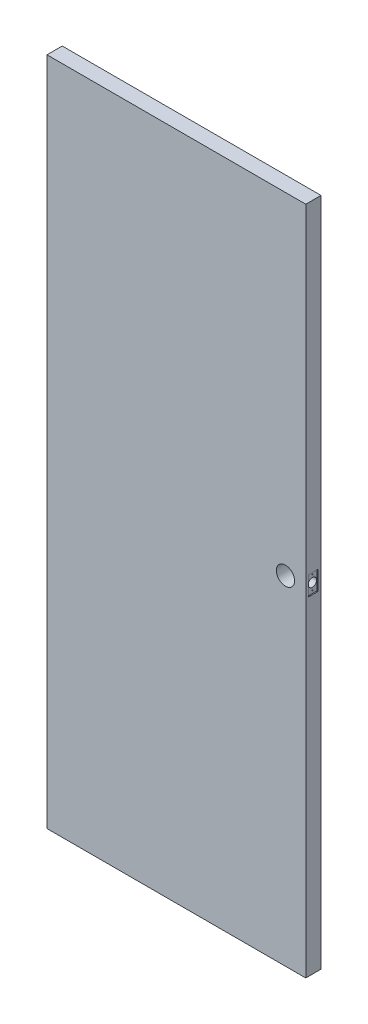
ISO-10303-21;
HEADER;
FILE_DESCRIPTION(('STEP AP214'),'2;1');
FILE_NAME('part.step','',(''),(''),'','','');
FILE_SCHEMA(('AUTOMOTIVE_DESIGN { 1 0 10303 214 1 1 1 1 }'));
ENDSEC;
DATA;
#1=APPLICATION_CONTEXT('core data for automotive mechanical design processes');
#2=APPLICATION_PROTOCOL_DEFINITION('international standard','automotive_design',2000,#1);
#3=PRODUCT_CONTEXT('',#1,'mechanical');
#4=PRODUCT('Part','Part','',(#3));
#5=PRODUCT_RELATED_PRODUCT_CATEGORY('part','',(#4));
#6=PRODUCT_DEFINITION_FORMATION('','',#4);
#7=PRODUCT_DEFINITION_CONTEXT('part definition',#1,'design');
#8=PRODUCT_DEFINITION('design','',#6,#7);
#9=PRODUCT_DEFINITION_SHAPE('','',#8);
#10=(LENGTH_UNIT() NAMED_UNIT(*) SI_UNIT(.MILLI.,.METRE.));
#11=(NAMED_UNIT(*) PLANE_ANGLE_UNIT() SI_UNIT($,.RADIAN.));
#12=(NAMED_UNIT(*) SI_UNIT($,.STERADIAN.) SOLID_ANGLE_UNIT());
#13=UNCERTAINTY_MEASURE_WITH_UNIT(LENGTH_MEASURE(1.E-05),#10,'distance_accuracy_value','');
#14=(GEOMETRIC_REPRESENTATION_CONTEXT(3) GLOBAL_UNCERTAINTY_ASSIGNED_CONTEXT((#13)) GLOBAL_UNIT_ASSIGNED_CONTEXT((#10,
#11,#12)) REPRESENTATION_CONTEXT('',''));
#15=CARTESIAN_POINT('',(0.,0.,0.));
#16=DIRECTION('',(0.,0.,1.));
#17=DIRECTION('',(1.,0.,0.));
#18=AXIS2_PLACEMENT_3D('',#15,#16,#17);
#19=CARTESIAN_POINT('',(-0.00100000000002876,1000.,22.5));
#20=DIRECTION('',(1.,0.,0.));
#21=DIRECTION('',(0.,0.,-1.));
#22=AXIS2_PLACEMENT_3D('',#19,#20,#21);
#23=CYLINDRICAL_SURFACE('',#22,12.5);
#24=CARTESIAN_POINT('',(732.,1000.,10.));
#25=CARTESIAN_POINT('',(731.999998002447,999.668422088761,10.0000023292743));
#26=CARTESIAN_POINT('',(731.993876440677,999.336779157179,10.0132099179336));
#27=CARTESIAN_POINT('',(731.969542185221,998.675898449838,10.0659042675992));
#28=CARTESIAN_POINT('',(731.951323109001,998.346662036484,10.1054049005938));
#29=CARTESIAN_POINT('',(731.903222023394,997.692533881601,10.210348474757));
#30=CARTESIAN_POINT('',(731.873316689022,997.367652181542,10.2758433027091));
#31=CARTESIAN_POINT('',(731.802623291495,996.725278561628,10.4320482504398));
#32=CARTESIAN_POINT('',(731.761836592468,996.407785720899,10.5227552095947));
#33=CARTESIAN_POINT('',(731.67057378094,995.7834036811,10.7280873639002));
#34=CARTESIAN_POINT('',(731.620133973199,995.476479681353,10.8426230768386));
#35=CARTESIAN_POINT('',(731.510684660548,994.873851344575,11.0947689030026));
#36=CARTESIAN_POINT('',(731.451674915464,994.578147322279,11.2323796629288));
#37=CARTESIAN_POINT('',(731.326491751328,993.999719630825,11.5294802018012));
#38=CARTESIAN_POINT('',(731.260321642744,993.716990048537,11.6889598790732));
#39=CARTESIAN_POINT('',(731.12226557469,993.165671942841,12.0287600834887));
#40=CARTESIAN_POINT('',(731.050377373706,992.897089034242,12.209088796221));
#41=CARTESIAN_POINT('',(730.898511464959,992.361365543337,12.5996472343398));
#42=CARTESIAN_POINT('',(730.818306596493,992.095081805128,12.8109643225546));
#43=CARTESIAN_POINT('',(730.655286671351,991.581033972636,13.2541260156496));
#44=CARTESIAN_POINT('',(730.572471490004,991.33327076483,13.4859716019587));
#45=CARTESIAN_POINT('',(730.406215284922,990.857363867813,13.9690432097703));
#46=CARTESIAN_POINT('',(730.322773954442,990.629230584159,14.2202793777351));
#47=CARTESIAN_POINT('',(730.157389610383,990.193880031075,14.7408019077799));
#48=CARTESIAN_POINT('',(730.075446862375,989.986666440073,15.0100914304786));
#49=CARTESIAN_POINT('',(729.910068553279,989.58177868194,15.5832420420382));
#50=CARTESIAN_POINT('',(729.82687521964,989.385572316778,15.8882127104353));
#51=CARTESIAN_POINT('',(729.667289866953,989.019807464747,16.5152648469024));
#52=CARTESIAN_POINT('',(729.590894995629,988.850237779464,16.8373390478071));
#53=CARTESIAN_POINT('',(729.447482436656,988.539199671144,17.4967122735494));
#54=CARTESIAN_POINT('',(729.380462393697,988.397724186027,17.83400744604));
#55=CARTESIAN_POINT('',(729.258260922285,988.144343377493,18.5216067566667));
#56=CARTESIAN_POINT('',(729.203078379146,988.032435269615,18.8719096662737));
#57=CARTESIAN_POINT('',(729.109421635052,987.844911955487,19.563180810335));
#58=CARTESIAN_POINT('',(729.070192607417,987.767632859612,19.9035950793588));
#59=CARTESIAN_POINT('',(729.005775202167,987.641691688417,20.5909991877625));
#60=CARTESIAN_POINT('',(728.980586302548,987.593028549169,20.9379887821796));
#61=CARTESIAN_POINT('',(728.945279280196,987.52502200683,21.6353691106166));
#62=CARTESIAN_POINT('',(728.935151348151,987.505659519877,21.9857574811567));
#63=CARTESIAN_POINT('',(728.930358970788,987.496482132574,22.6870147093001));
#64=CARTESIAN_POINT('',(728.935693391853,987.506665066112,23.0378835297942));
#65=CARTESIAN_POINT('',(728.960309439594,987.553949811395,23.7023075068291));
#66=CARTESIAN_POINT('',(728.978157901728,987.588286641967,24.0161176181592));
#67=CARTESIAN_POINT('',(729.025617311446,987.680405966638,24.6393487972412));
#68=CARTESIAN_POINT('',(729.055227354877,987.738186658535,24.9487702004752));
#69=CARTESIAN_POINT('',(729.125270949122,987.876580449968,25.5612585504465));
#70=CARTESIAN_POINT('',(729.165706554747,987.957197884339,25.8643242790183));
#71=CARTESIAN_POINT('',(729.25617478444,988.140471526853,26.4622432955294));
#72=CARTESIAN_POINT('',(729.306207857588,988.2431287663,26.7570961984382));
#73=CARTESIAN_POINT('',(729.415681060451,988.472164924883,27.3435907186567));
#74=CARTESIAN_POINT('',(729.475309089342,988.599029803314,27.6350071779858));
#75=CARTESIAN_POINT('',(729.601492511707,988.873929898133,28.2062314693331));
#76=CARTESIAN_POINT('',(729.668050402359,989.021972753249,28.4860350654999));
#77=CARTESIAN_POINT('',(729.806375935256,989.338222752103,29.0327053438451));
#78=CARTESIAN_POINT('',(729.878144394206,989.506433059594,29.2995699869903));
#79=CARTESIAN_POINT('',(730.0251587382,989.8620295164,29.8191999142336));
#80=CARTESIAN_POINT('',(730.100404863738,990.049416992979,30.0719642205662));
#81=CARTESIAN_POINT('',(730.260811815036,990.463449830648,30.5885839334457));
#82=CARTESIAN_POINT('',(730.346172212179,990.69215041206,30.8507335191324));
#83=CARTESIAN_POINT('',(730.516752133651,991.170514419783,31.3549943936451));
#84=CARTESIAN_POINT('',(730.601971698225,991.420170110671,31.5971130117875));
#85=CARTESIAN_POINT('',(730.770170579597,991.939427311406,32.0602448425317));
#86=CARTESIAN_POINT('',(730.853148116905,992.209044064296,32.2812416244214));
#87=CARTESIAN_POINT('',(731.014636740145,992.766545995786,32.7004276246339));
#88=CARTESIAN_POINT('',(731.093149622741,993.054423725738,32.8986260507639));
#89=CARTESIAN_POINT('',(731.246350432207,993.657354201341,33.2773816460067));
#90=CARTESIAN_POINT('',(731.320809390704,993.973004601278,33.4570822419527));
#91=CARTESIAN_POINT('',(731.46071248318,994.620376764097,33.7890196935255));
#92=CARTESIAN_POINT('',(731.526156291861,994.952099106326,33.9412555581931));
#93=CARTESIAN_POINT('',(731.646080640694,995.629131353904,34.2166109326683));
#94=CARTESIAN_POINT('',(731.700567209032,995.97443366245,34.3397464587554));
#95=CARTESIAN_POINT('',(731.796963703763,996.676131920866,34.5555629923018));
#96=CARTESIAN_POINT('',(731.838874844723,997.032526795715,34.6482469409353));
#97=CARTESIAN_POINT('',(731.906207462756,997.726590860271,34.7962596081731));
#98=CARTESIAN_POINT('',(731.93262339186,998.063681756838,34.853853630447));
#99=CARTESIAN_POINT('',(731.972826795685,998.742192371953,34.9412579829527));
#100=CARTESIAN_POINT('',(731.986614891807,999.083611876658,34.9710696803249));
#101=CARTESIAN_POINT('',(732.001170776422,999.767911454575,35.0025364139408));
#102=CARTESIAN_POINT('',(732.001942776283,1000.11079101947,35.0042005573506));
#103=CARTESIAN_POINT('',(731.990454774749,1000.79530317664,34.9793739128589));
#104=CARTESIAN_POINT('',(731.978195202305,1001.1369358096,34.9528840516833));
#105=CARTESIAN_POINT('',(731.942192477616,1001.7943207997,34.8746856095642));
#106=CARTESIAN_POINT('',(731.919238598402,1002.11032451672,34.8247085346885));
#107=CARTESIAN_POINT('',(731.862792148742,1002.73665069614,34.7009276708533));
#108=CARTESIAN_POINT('',(731.829300140859,1003.04697346088,34.6271251537757));
#109=CARTESIAN_POINT('',(731.752570857058,1003.65997073146,34.4564148603405));
#110=CARTESIAN_POINT('',(731.709332964537,1003.96264475203,34.3595056220429));
#111=CARTESIAN_POINT('',(731.614109587101,1004.5585332442,34.1434628193551));
#112=CARTESIAN_POINT('',(731.562123752895,1004.85174733752,34.0243283675231));
#113=CARTESIAN_POINT('',(731.448859367079,1005.43590297559,33.7608497999407));
#114=CARTESIAN_POINT('',(731.387345438136,1005.72650142557,33.6158467076901));
#115=CARTESIAN_POINT('',(731.257647426588,1006.29451044103,33.304355702977));
#116=CARTESIAN_POINT('',(731.189460946475,1006.57191621268,33.1378600611432));
#117=CARTESIAN_POINT('',(731.047942159905,1007.1121517761,32.7845270705439));
#118=CARTESIAN_POINT('',(730.97460872244,1007.37497834135,32.5976852458446));
#119=CARTESIAN_POINT('',(730.824422135181,1007.8847858184,32.2048296901034));
#120=CARTESIAN_POINT('',(730.747569105365,1008.13176726965,31.9988166123398));
#121=CARTESIAN_POINT('',(730.58526394341,1008.62951918284,31.5500391804311));
#122=CARTESIAN_POINT('',(730.499644091669,1008.87876057277,31.3056370408377));
#123=CARTESIAN_POINT('',(730.328447301136,1009.35596249524,30.7968444935493));
#124=CARTESIAN_POINT('',(730.24287036468,1009.58392197323,30.5324530965312));
#125=CARTESIAN_POINT('',(730.074024651927,1010.01735543162,29.9849540358408));
#126=CARTESIAN_POINT('',(729.990756816071,1010.22282034813,29.7018389008449));
#127=CARTESIAN_POINT('',(729.828907380942,1010.60987173198,29.1183977359458));
#128=CARTESIAN_POINT('',(729.75032636771,1010.79145521658,28.8180695628905));
#129=CARTESIAN_POINT('',(729.597889486629,1011.13463942771,28.1921965750285));
#130=CARTESIAN_POINT('',(729.524257367953,1011.29544048205,27.8661574664116));
#131=CARTESIAN_POINT('',(729.387096528789,1011.58860330392,27.1996529851551));
#132=CARTESIAN_POINT('',(729.323563027758,1011.72097853831,26.859194535678));
#133=CARTESIAN_POINT('',(729.2089888989,1011.95583297549,26.1663021227683));
#134=CARTESIAN_POINT('',(729.157940141583,1012.05833164092,25.8138761232562));
#135=CARTESIAN_POINT('',(729.070370907316,1012.23220177018,25.0996665219084));
#136=CARTESIAN_POINT('',(729.033848591179,1012.30357717463,24.7378841108664));
#137=CARTESIAN_POINT('',(728.979456262878,1012.40922500796,24.0408048554866));
#138=CARTESIAN_POINT('',(728.960211397828,1012.44624245167,23.7060292923018));
#139=CARTESIAN_POINT('',(728.935800565152,1012.49312478279,23.0340747125841));
#140=CARTESIAN_POINT('',(728.930633720352,1012.50299136193,22.6968958471091));
#141=CARTESIAN_POINT('',(728.934577570304,1012.4954395509,22.0230114925559));
#142=CARTESIAN_POINT('',(728.943684949675,1012.47802749657,21.6863059117301));
#143=CARTESIAN_POINT('',(728.975821329516,1012.41616696706,21.0160687907706));
#144=CARTESIAN_POINT('',(728.998850018876,1012.37171909607,20.6825371798751));
#145=CARTESIAN_POINT('',(729.055861942092,1012.26046888288,20.0447729393511));
#146=CARTESIAN_POINT('',(729.088951367825,1012.19547766473,19.7401413486756));
#147=CARTESIAN_POINT('',(729.165385576091,1012.04331286044,19.1376830667892));
#148=CARTESIAN_POINT('',(729.20873382275,1011.95613178064,18.8398587115292));
#149=CARTESIAN_POINT('',(729.304416754455,1011.76040719833,18.2528169077572));
#150=CARTESIAN_POINT('',(729.356751443573,1011.65186368614,17.9635994631452));
#151=CARTESIAN_POINT('',(729.468984507458,1011.41429136517,17.3952133095522));
#152=CARTESIAN_POINT('',(729.528883541773,1011.28526076982,17.1160454795464));
#153=CARTESIAN_POINT('',(729.658872556049,1010.99847208286,16.551008800755));
#154=CARTESIAN_POINT('',(729.72937401517,1010.83938107201,16.2659110681214));
#155=CARTESIAN_POINT('',(729.87534862186,1010.50005406822,15.7099379846379));
#156=CARTESIAN_POINT('',(729.95082192564,1010.31981741076,15.4390630811362));
#157=CARTESIAN_POINT('',(730.104869473538,1009.93919931139,14.9126523276877));
#158=CARTESIAN_POINT('',(730.183444742502,1009.73881117729,14.6571216187524));
#159=CARTESIAN_POINT('',(730.341811170788,1009.31895665893,14.1625976325898));
#160=CARTESIAN_POINT('',(730.421602502945,1009.09948754151,13.9236067333728));
#161=CARTESIAN_POINT('',(730.588393234833,1008.62001858761,13.4406307683937));
#162=CARTESIAN_POINT('',(730.675329185726,1008.35815559465,13.1984690048692));
#163=CARTESIAN_POINT('',(730.846074602858,1007.81419586295,12.7370339300526));
#164=CARTESIAN_POINT('',(730.92988510694,1007.53210593341,12.5177529766264));
#165=CARTESIAN_POINT('',(731.092222890284,1006.9489257823,12.1033432132673));
#166=CARTESIAN_POINT('',(731.17074619966,1006.64782160551,11.9082324611957));
#167=CARTESIAN_POINT('',(731.320294507113,1006.02855979943,11.543928796161));
#168=CARTESIAN_POINT('',(731.391320042185,1005.7104033939,11.3747340266876));
#169=CARTESIAN_POINT('',(731.523464311231,1005.06111467693,11.0648048984841));
#170=CARTESIAN_POINT('',(731.58464362823,1004.73007861109,10.9238950641157));
#171=CARTESIAN_POINT('',(731.695897050195,1004.05536304014,10.670635169424));
#172=CARTESIAN_POINT('',(731.745969462335,1003.71168161703,10.5582894622394));
#173=CARTESIAN_POINT('',(731.833388973569,1003.01530510901,10.3637610725984));
#174=CARTESIAN_POINT('',(731.870769661409,1002.66263651378,10.2814987290438));
#175=CARTESIAN_POINT('',(731.931822002458,1001.95051104947,10.1478099963477));
#176=CARTESIAN_POINT('',(731.955502809403,1001.59105887914,10.0963630167452));
#177=CARTESIAN_POINT('',(731.981288768876,1001.02563525442,10.0404565701127));
#178=CARTESIAN_POINT('',(731.988298104388,1000.8208802782,10.0252931071275));
#179=CARTESIAN_POINT('',(731.997654381966,1000.41075852501,10.0050640067928));
#180=CARTESIAN_POINT('',(732.000001237359,1000.20539173674,9.99999855716059));
#181=CARTESIAN_POINT('',(732.,1000.,10.));
#182=B_SPLINE_CURVE_WITH_KNOTS('',3,(#24,#25,#26,#27,#28,#29,#30,#31,#32,#33,#34,#35,#36,#37,
#38,#39,#40,#41,#42,#43,#44,#45,#46,#47,#48,#49,#50,#51,#52,#53,#54,#55,#56,#57,#58,#59,#60,#61,
#62,#63,#64,#65,#66,#67,#68,#69,#70,#71,#72,#73,#74,#75,#76,#77,#78,#79,#80,#81,#82,#83,#84,#85,
#86,#87,#88,#89,#90,#91,#92,#93,#94,#95,#96,#97,#98,#99,#100,#101,#102,#103,#104,#105,#106,#107,
#108,#109,#110,#111,#112,#113,#114,#115,#116,#117,#118,#119,#120,#121,#122,#123,#124,#125,#126,
#127,#128,#129,#130,#131,#132,#133,#134,#135,#136,#137,#138,#139,#140,#141,#142,#143,#144,#145,
#146,#147,#148,#149,#150,#151,#152,#153,#154,#155,#156,#157,#158,#159,#160,#161,#162,#163,#164,
#165,#166,#167,#168,#169,#170,#171,#172,#173,#174,#175,#176,#177,#178,#179,#180,#181),
.UNSPECIFIED.,.T.,.F.,(4,2,2,2,2,2,2,2,2,2,2,2,2,2,2,2,2,2,2,2,2,2,2,2,2,2,2,2,2,2,2,2,2,2,2,2,
2,2,2,2,2,2,2,2,2,2,2,2,2,2,2,2,2,2,2,2,2,2,2,2,2,2,2,2,2,2,2,2,2,2,2,2,2,2,2,2,2,2,4),(0.,
0.994528985060413,1.98958309154408,2.98663348748122,3.98355894829082,4.97680620638525,
5.97008130585068,6.96289912832716,7.95610807553238,9.00281218361373,10.0495663597,
11.0968720310039,12.1443615363848,13.259137856263,14.3734442477634,15.4874701788891,
16.6013911609791,17.6537534221179,18.7060765544402,19.7577140008262,20.809274348728,
21.7567226158427,22.7040980634081,23.6516534608806,24.5992532067505,25.5683821321694,
26.5378615001713,27.5074931539078,28.4771919618501,29.5506185450002,30.6236506088654,
31.6975107057955,32.7709355575334,33.8818053930425,34.9927153020036,36.1030123556248,
37.2132021393455,38.240835559975,39.2684184091204,40.2956687765619,41.322885331759,
42.2840367794968,43.2451369262296,44.2062978969834,45.167497254631,46.1580617752712,
47.148983530548,48.1401237196649,49.1312301471257,50.2082920748067,51.2854073441793,
52.362955038245,53.4406371877421,54.551924072665,55.6626833131646,56.7727173409769,
57.8826107829373,58.8933496517613,59.9040255419017,60.9144667237074,61.9248853252646,
62.8635679111351,63.8025679180065,64.7415683503573,65.6806507124922,66.6816292250223,
67.6826392023157,68.6839827139265,69.6854698958439,70.7855197216834,71.8852009495488,
72.985698870598,74.0861179197721,75.1794834378249,76.2730154837198,77.3636305095056,
78.4535159839474,79.0695529134892,79.6856012947562),.UNSPECIFIED.);
#183=CARTESIAN_POINT('',(732.,1000.,10.));
#184=VERTEX_POINT('',#183);
#185=EDGE_CURVE('E151',#184,#184,#182,.T.);
#186=ORIENTED_EDGE('',*,*,#185,.T.);
#187=EDGE_LOOP('',(#186));
#188=FACE_BOUND('',#187,.T.);
#189=CARTESIAN_POINT('',(762.,1000.,22.5));
#190=DIRECTION('',(1.,0.,0.));
#191=DIRECTION('',(0.,0.,-1.));
#192=AXIS2_PLACEMENT_3D('',#189,#190,#191);
#193=CIRCLE('',#192,12.5);
#194=CARTESIAN_POINT('',(762.,1000.,10.));
#195=VERTEX_POINT('',#194);
#196=EDGE_CURVE('E37',#195,#195,#193,.F.);
#197=ORIENTED_EDGE('',*,*,#196,.F.);
#198=EDGE_LOOP('',(#197));
#199=FACE_BOUND('',#198,.T.);
#200=ADVANCED_FACE('F33',(#188,#199),#23,.F.);
#201=CARTESIAN_POINT('',(0.,0.,45.));
#202=DIRECTION('',(1.,0.,0.));
#203=DIRECTION('',(0.,0.,-1.));
#204=AXIS2_PLACEMENT_3D('',#201,#202,#203);
#205=PLANE('',#204);
#206=DIRECTION('',(0.,-1.,0.));
#207=VECTOR('',#206,1.);
#208=CARTESIAN_POINT('',(0.,0.,0.));
#209=LINE('',#208,#207);
#210=CARTESIAN_POINT('',(0.,1981.,0.));
#211=VERTEX_POINT('',#210);
#212=CARTESIAN_POINT('',(0.,0.,0.));
#213=VERTEX_POINT('',#212);
#214=EDGE_CURVE('E221',#211,#213,#209,.T.);
#215=ORIENTED_EDGE('',*,*,#214,.T.);
#216=DIRECTION('',(0.,0.,-1.));
#217=VECTOR('',#216,1.);
#218=CARTESIAN_POINT('',(0.,0.,45.));
#219=LINE('',#218,#217);
#220=CARTESIAN_POINT('',(0.,0.,45.));
#221=VERTEX_POINT('',#220);
#222=EDGE_CURVE('E11',#221,#213,#219,.T.);
#223=ORIENTED_EDGE('',*,*,#222,.F.);
#224=DIRECTION('',(0.,-1.,0.));
#225=VECTOR('',#224,1.);
#226=CARTESIAN_POINT('',(0.,0.,45.));
#227=LINE('',#226,#225);
#228=CARTESIAN_POINT('',(0.,1981.,45.));
#229=VERTEX_POINT('',#228);
#230=EDGE_CURVE('E223',#229,#221,#227,.T.);
#231=ORIENTED_EDGE('',*,*,#230,.F.);
#232=DIRECTION('',(0.,0.,-1.));
#233=VECTOR('',#232,1.);
#234=CARTESIAN_POINT('',(0.,1981.,45.));
#235=LINE('',#234,#233);
#236=EDGE_CURVE('E229',#229,#211,#235,.T.);
#237=ORIENTED_EDGE('',*,*,#236,.T.);
#238=EDGE_LOOP('',(#215,#223,#231,#237));
#239=FACE_BOUND('',#238,.T.);
#240=ADVANCED_FACE('F35',(#239),#205,.F.);
#241=CARTESIAN_POINT('',(0.,0.,45.));
#242=DIRECTION('',(0.,1.,0.));
#243=DIRECTION('',(0.,0.,1.));
#244=AXIS2_PLACEMENT_3D('',#241,#242,#243);
#245=PLANE('',#244);
#246=DIRECTION('',(1.,0.,0.));
#247=VECTOR('',#246,1.);
#248=CARTESIAN_POINT('',(0.,0.,0.));
#249=LINE('',#248,#247);
#250=CARTESIAN_POINT('',(765.,0.,0.));
#251=VERTEX_POINT('',#250);
#252=EDGE_CURVE('E232',#213,#251,#249,.T.);
#253=ORIENTED_EDGE('',*,*,#252,.T.);
#254=DIRECTION('',(0.,0.,-1.));
#255=VECTOR('',#254,1.);
#256=CARTESIAN_POINT('',(765.,0.,45.));
#257=LINE('',#256,#255);
#258=CARTESIAN_POINT('',(765.,0.,45.));
#259=VERTEX_POINT('',#258);
#260=EDGE_CURVE('E42',#259,#251,#257,.T.);
#261=ORIENTED_EDGE('',*,*,#260,.F.);
#262=DIRECTION('',(1.,0.,0.));
#263=VECTOR('',#262,1.);
#264=CARTESIAN_POINT('',(0.,0.,45.));
#265=LINE('',#264,#263);
#266=EDGE_CURVE('E86',#221,#259,#265,.T.);
#267=ORIENTED_EDGE('',*,*,#266,.F.);
#268=ORIENTED_EDGE('',*,*,#222,.T.);
#269=EDGE_LOOP('',(#253,#261,#267,#268));
#270=FACE_BOUND('',#269,.T.);
#271=ADVANCED_FACE('F205',(#270),#245,.F.);
#272=CARTESIAN_POINT('',(765.,0.,45.));
#273=DIRECTION('',(-1.,0.,0.));
#274=DIRECTION('',(0.,0.,1.));
#275=AXIS2_PLACEMENT_3D('',#272,#273,#274);
#276=PLANE('',#275);
#277=DIRECTION('',(0.,0.,-1.));
#278=VECTOR('',#277,1.);
#279=CARTESIAN_POINT('',(765.,971.5,36.75));
#280=LINE('',#279,#278);
#281=CARTESIAN_POINT('',(765.,971.5,36.75));
#282=VERTEX_POINT('',#281);
#283=CARTESIAN_POINT('',(765.,971.5,8.24999999999999));
#284=VERTEX_POINT('',#283);
#285=EDGE_CURVE('E141',#282,#284,#280,.T.);
#286=ORIENTED_EDGE('',*,*,#285,.F.);
#287=DIRECTION('',(0.,-1.,0.));
#288=VECTOR('',#287,1.);
#289=CARTESIAN_POINT('',(765.,1028.5,36.75));
#290=LINE('',#289,#288);
#291=CARTESIAN_POINT('',(765.,1028.5,36.75));
#292=VERTEX_POINT('',#291);
#293=EDGE_CURVE('E49',#292,#282,#290,.T.);
#294=ORIENTED_EDGE('',*,*,#293,.F.);
#295=DIRECTION('',(0.,0.,1.));
#296=VECTOR('',#295,1.);
#297=CARTESIAN_POINT('',(765.,1028.5,36.75));
#298=LINE('',#297,#296);
#299=CARTESIAN_POINT('',(765.,1028.5,8.25));
#300=VERTEX_POINT('',#299);
#301=EDGE_CURVE('E129',#300,#292,#298,.T.);
#302=ORIENTED_EDGE('',*,*,#301,.F.);
#303=DIRECTION('',(0.,1.,0.));
#304=VECTOR('',#303,1.);
#305=CARTESIAN_POINT('',(765.,1028.5,8.25));
#306=LINE('',#305,#304);
#307=EDGE_CURVE('E132',#284,#300,#306,.T.);
#308=ORIENTED_EDGE('',*,*,#307,.F.);
#309=EDGE_LOOP('',(#286,#294,#302,#308));
#310=FACE_BOUND('',#309,.T.);
#311=DIRECTION('',(0.,1.,0.));
#312=VECTOR('',#311,1.);
#313=CARTESIAN_POINT('',(765.,0.,0.));
#314=LINE('',#313,#312);
#315=CARTESIAN_POINT('',(765.,1981.,0.));
#316=VERTEX_POINT('',#315);
#317=EDGE_CURVE('E234',#251,#316,#314,.T.);
#318=ORIENTED_EDGE('',*,*,#317,.T.);
#319=DIRECTION('',(0.,0.,-1.));
#320=VECTOR('',#319,1.);
#321=CARTESIAN_POINT('',(765.,1981.,45.));
#322=LINE('',#321,#320);
#323=CARTESIAN_POINT('',(765.,1981.,45.));
#324=VERTEX_POINT('',#323);
#325=EDGE_CURVE('E238',#324,#316,#322,.T.);
#326=ORIENTED_EDGE('',*,*,#325,.F.);
#327=DIRECTION('',(0.,1.,0.));
#328=VECTOR('',#327,1.);
#329=CARTESIAN_POINT('',(765.,0.,45.));
#330=LINE('',#329,#328);
#331=EDGE_CURVE('E226',#259,#324,#330,.T.);
#332=ORIENTED_EDGE('',*,*,#331,.F.);
#333=ORIENTED_EDGE('',*,*,#260,.T.);
#334=EDGE_LOOP('',(#318,#326,#332,#333));
#335=FACE_BOUND('',#334,.T.);
#336=ADVANCED_FACE('F244',(#310,#335),#276,.F.);
#337=CARTESIAN_POINT('',(0.,1981.,45.));
#338=DIRECTION('',(0.,-1.,0.));
#339=DIRECTION('',(0.,0.,-1.));
#340=AXIS2_PLACEMENT_3D('',#337,#338,#339);
#341=PLANE('',#340);
#342=DIRECTION('',(-1.,0.,0.));
#343=VECTOR('',#342,1.);
#344=CARTESIAN_POINT('',(0.,1981.,0.));
#345=LINE('',#344,#343);
#346=EDGE_CURVE('E79',#316,#211,#345,.T.);
#347=ORIENTED_EDGE('',*,*,#346,.T.);
#348=ORIENTED_EDGE('',*,*,#236,.F.);
#349=DIRECTION('',(-1.,0.,0.));
#350=VECTOR('',#349,1.);
#351=CARTESIAN_POINT('',(0.,1981.,45.));
#352=LINE('',#351,#350);
#353=EDGE_CURVE('E58',#324,#229,#352,.T.);
#354=ORIENTED_EDGE('',*,*,#353,.F.);
#355=ORIENTED_EDGE('',*,*,#325,.T.);
#356=EDGE_LOOP('',(#347,#348,#354,#355));
#357=FACE_BOUND('',#356,.T.);
#358=ADVANCED_FACE('F250',(#357),#341,.F.);
#359=CARTESIAN_POINT('',(0.,0.,45.));
#360=DIRECTION('',(0.,0.,-1.));
#361=DIRECTION('',(-1.,0.,0.));
#362=AXIS2_PLACEMENT_3D('',#359,#360,#361);
#363=PLANE('',#362);
#364=CARTESIAN_POINT('',(705.,1000.,45.));
#365=DIRECTION('',(0.,0.,1.));
#366=DIRECTION('',(1.,0.,0.));
#367=AXIS2_PLACEMENT_3D('',#364,#365,#366);
#368=CIRCLE('',#367,27.);
#369=CARTESIAN_POINT('',(732.,1000.,45.));
#370=VERTEX_POINT('',#369);
#371=EDGE_CURVE('E159',#370,#370,#368,.T.);
#372=ORIENTED_EDGE('',*,*,#371,.F.);
#373=EDGE_LOOP('',(#372));
#374=FACE_BOUND('',#373,.T.);
#375=ORIENTED_EDGE('',*,*,#230,.T.);
#376=ORIENTED_EDGE('',*,*,#266,.T.);
#377=ORIENTED_EDGE('',*,*,#331,.T.);
#378=ORIENTED_EDGE('',*,*,#353,.T.);
#379=EDGE_LOOP('',(#375,#376,#377,#378));
#380=FACE_BOUND('',#379,.T.);
#381=ADVANCED_FACE('F252',(#374,#380),#363,.F.);
#382=CARTESIAN_POINT('',(0.,0.,0.));
#383=DIRECTION('',(0.,0.,-1.));
#384=DIRECTION('',(-1.,0.,0.));
#385=AXIS2_PLACEMENT_3D('',#382,#383,#384);
#386=PLANE('',#385);
#387=CARTESIAN_POINT('',(705.,1000.,0.));
#388=DIRECTION('',(0.,0.,1.));
#389=DIRECTION('',(1.,0.,0.));
#390=AXIS2_PLACEMENT_3D('',#387,#388,#389);
#391=CIRCLE('',#390,27.);
#392=CARTESIAN_POINT('',(732.,1000.,0.));
#393=VERTEX_POINT('',#392);
#394=EDGE_CURVE('E160',#393,#393,#391,.T.);
#395=ORIENTED_EDGE('',*,*,#394,.T.);
#396=EDGE_LOOP('',(#395));
#397=FACE_BOUND('',#396,.T.);
#398=ORIENTED_EDGE('',*,*,#214,.F.);
#399=ORIENTED_EDGE('',*,*,#346,.F.);
#400=ORIENTED_EDGE('',*,*,#317,.F.);
#401=ORIENTED_EDGE('',*,*,#252,.F.);
#402=EDGE_LOOP('',(#398,#399,#400,#401));
#403=FACE_BOUND('',#402,.T.);
#404=ADVANCED_FACE('F214',(#397,#403),#386,.T.);
#405=CARTESIAN_POINT('',(705.,1000.,0.));
#406=DIRECTION('',(0.,0.,1.));
#407=DIRECTION('',(1.,0.,0.));
#408=AXIS2_PLACEMENT_3D('',#405,#406,#407);
#409=CYLINDRICAL_SURFACE('',#408,27.);
#410=ORIENTED_EDGE('',*,*,#185,.F.);
#411=EDGE_LOOP('',(#410));
#412=FACE_BOUND('',#411,.T.);
#413=ORIENTED_EDGE('',*,*,#394,.F.);
#414=EDGE_LOOP('',(#413));
#415=FACE_BOUND('',#414,.T.);
#416=ORIENTED_EDGE('',*,*,#371,.T.);
#417=EDGE_LOOP('',(#416));
#418=FACE_BOUND('',#417,.T.);
#419=ADVANCED_FACE('F181',(#412,#415,#418),#409,.F.);
#420=CARTESIAN_POINT('',(762.,0.,0.));
#421=DIRECTION('',(1.,0.,0.));
#422=DIRECTION('',(0.,0.,-1.));
#423=AXIS2_PLACEMENT_3D('',#420,#421,#422);
#424=PLANE('',#423);
#425=CARTESIAN_POINT('',(762.,1020.5,22.5));
#426=DIRECTION('',(1.,0.,0.));
#427=DIRECTION('',(0.,0.,-1.));
#428=AXIS2_PLACEMENT_3D('',#425,#426,#427);
#429=CIRCLE('',#428,1.49999999999997);
#430=CARTESIAN_POINT('',(762.,1020.5,21.));
#431=VERTEX_POINT('',#430);
#432=EDGE_CURVE('E364',#431,#431,#429,.T.);
#433=ORIENTED_EDGE('',*,*,#432,.F.);
#434=EDGE_LOOP('',(#433));
#435=FACE_BOUND('',#434,.T.);
#436=CARTESIAN_POINT('',(762.,979.5,22.5));
#437=DIRECTION('',(1.,0.,0.));
#438=DIRECTION('',(0.,0.,-1.));
#439=AXIS2_PLACEMENT_3D('',#436,#437,#438);
#440=CIRCLE('',#439,1.5);
#441=CARTESIAN_POINT('',(762.,979.5,21.));
#442=VERTEX_POINT('',#441);
#443=EDGE_CURVE('E135',#442,#442,#440,.T.);
#444=ORIENTED_EDGE('',*,*,#443,.F.);
#445=EDGE_LOOP('',(#444));
#446=FACE_BOUND('',#445,.T.);
#447=DIRECTION('',(0.,-1.,0.));
#448=VECTOR('',#447,1.);
#449=CARTESIAN_POINT('',(762.,1028.5,36.75));
#450=LINE('',#449,#448);
#451=CARTESIAN_POINT('',(762.,1028.5,36.75));
#452=VERTEX_POINT('',#451);
#453=CARTESIAN_POINT('',(762.,971.5,36.75));
#454=VERTEX_POINT('',#453);
#455=EDGE_CURVE('E110',#452,#454,#450,.T.);
#456=ORIENTED_EDGE('',*,*,#455,.T.);
#457=DIRECTION('',(0.,0.,-1.));
#458=VECTOR('',#457,1.);
#459=CARTESIAN_POINT('',(762.,971.5,36.75));
#460=LINE('',#459,#458);
#461=CARTESIAN_POINT('',(762.,971.5,8.24999999999999));
#462=VERTEX_POINT('',#461);
#463=EDGE_CURVE('E119',#454,#462,#460,.T.);
#464=ORIENTED_EDGE('',*,*,#463,.T.);
#465=DIRECTION('',(0.,1.,0.));
#466=VECTOR('',#465,1.);
#467=CARTESIAN_POINT('',(762.,1028.5,8.25));
#468=LINE('',#467,#466);
#469=CARTESIAN_POINT('',(762.,1028.5,8.25));
#470=VERTEX_POINT('',#469);
#471=EDGE_CURVE('E124',#462,#470,#468,.T.);
#472=ORIENTED_EDGE('',*,*,#471,.T.);
#473=DIRECTION('',(0.,0.,1.));
#474=VECTOR('',#473,1.);
#475=CARTESIAN_POINT('',(762.,1028.5,36.75));
#476=LINE('',#475,#474);
#477=EDGE_CURVE('E116',#470,#452,#476,.T.);
#478=ORIENTED_EDGE('',*,*,#477,.T.);
#479=EDGE_LOOP('',(#456,#464,#472,#478));
#480=FACE_BOUND('',#479,.T.);
#481=ORIENTED_EDGE('',*,*,#196,.T.);
#482=EDGE_LOOP('',(#481));
#483=FACE_BOUND('',#482,.T.);
#484=ADVANCED_FACE('F126',(#435,#446,#480,#483),#424,.T.);
#485=CARTESIAN_POINT('',(762.,1028.5,36.75));
#486=DIRECTION('',(0.,0.,1.));
#487=DIRECTION('',(0.,-1.,0.));
#488=AXIS2_PLACEMENT_3D('',#485,#486,#487);
#489=PLANE('',#488);
#490=ORIENTED_EDGE('',*,*,#293,.T.);
#491=DIRECTION('',(1.,0.,0.));
#492=VECTOR('',#491,1.);
#493=CARTESIAN_POINT('',(762.,971.5,36.75));
#494=LINE('',#493,#492);
#495=EDGE_CURVE('E106',#454,#282,#494,.T.);
#496=ORIENTED_EDGE('',*,*,#495,.F.);
#497=ORIENTED_EDGE('',*,*,#455,.F.);
#498=DIRECTION('',(1.,0.,0.));
#499=VECTOR('',#498,1.);
#500=CARTESIAN_POINT('',(762.,1028.5,36.75));
#501=LINE('',#500,#499);
#502=EDGE_CURVE('E146',#452,#292,#501,.T.);
#503=ORIENTED_EDGE('',*,*,#502,.T.);
#504=EDGE_LOOP('',(#490,#496,#497,#503));
#505=FACE_BOUND('',#504,.T.);
#506=ADVANCED_FACE('F108',(#505),#489,.F.);
#507=CARTESIAN_POINT('',(762.,1028.5,36.75));
#508=DIRECTION('',(0.,1.,0.));
#509=DIRECTION('',(0.,0.,1.));
#510=AXIS2_PLACEMENT_3D('',#507,#508,#509);
#511=PLANE('',#510);
#512=ORIENTED_EDGE('',*,*,#301,.T.);
#513=ORIENTED_EDGE('',*,*,#502,.F.);
#514=ORIENTED_EDGE('',*,*,#477,.F.);
#515=DIRECTION('',(1.,0.,0.));
#516=VECTOR('',#515,1.);
#517=CARTESIAN_POINT('',(762.,1028.5,8.25));
#518=LINE('',#517,#516);
#519=EDGE_CURVE('E148',#470,#300,#518,.T.);
#520=ORIENTED_EDGE('',*,*,#519,.T.);
#521=EDGE_LOOP('',(#512,#513,#514,#520));
#522=FACE_BOUND('',#521,.T.);
#523=ADVANCED_FACE('F168',(#522),#511,.F.);
#524=CARTESIAN_POINT('',(762.,1028.5,8.25));
#525=DIRECTION('',(0.,0.,-1.));
#526=DIRECTION('',(0.,1.,0.));
#527=AXIS2_PLACEMENT_3D('',#524,#525,#526);
#528=PLANE('',#527);
#529=ORIENTED_EDGE('',*,*,#307,.T.);
#530=ORIENTED_EDGE('',*,*,#519,.F.);
#531=ORIENTED_EDGE('',*,*,#471,.F.);
#532=DIRECTION('',(1.,0.,0.));
#533=VECTOR('',#532,1.);
#534=CARTESIAN_POINT('',(762.,971.5,8.24999999999999));
#535=LINE('',#534,#533);
#536=EDGE_CURVE('E115',#462,#284,#535,.T.);
#537=ORIENTED_EDGE('',*,*,#536,.T.);
#538=EDGE_LOOP('',(#529,#530,#531,#537));
#539=FACE_BOUND('',#538,.T.);
#540=ADVANCED_FACE('F172',(#539),#528,.F.);
#541=CARTESIAN_POINT('',(762.,971.5,36.75));
#542=DIRECTION('',(0.,-1.,0.));
#543=DIRECTION('',(0.,0.,-1.));
#544=AXIS2_PLACEMENT_3D('',#541,#542,#543);
#545=PLANE('',#544);
#546=ORIENTED_EDGE('',*,*,#285,.T.);
#547=ORIENTED_EDGE('',*,*,#536,.F.);
#548=ORIENTED_EDGE('',*,*,#463,.F.);
#549=ORIENTED_EDGE('',*,*,#495,.T.);
#550=EDGE_LOOP('',(#546,#547,#548,#549));
#551=FACE_BOUND('',#550,.T.);
#552=ADVANCED_FACE('F120',(#551),#545,.F.);
#553=CARTESIAN_POINT('',(747.,979.5,22.5));
#554=DIRECTION('',(1.,0.,0.));
#555=DIRECTION('',(0.,0.,-1.));
#556=AXIS2_PLACEMENT_3D('',#553,#554,#555);
#557=CYLINDRICAL_SURFACE('',#556,1.5);
#558=CARTESIAN_POINT('',(747.,979.5,22.5));
#559=DIRECTION('',(1.,0.,0.));
#560=DIRECTION('',(0.,0.,-1.));
#561=AXIS2_PLACEMENT_3D('',#558,#559,#560);
#562=CIRCLE('',#561,1.5);
#563=CARTESIAN_POINT('',(747.,979.5,21.));
#564=VERTEX_POINT('',#563);
#565=EDGE_CURVE('E367',#564,#564,#562,.T.);
#566=ORIENTED_EDGE('',*,*,#565,.F.);
#567=EDGE_LOOP('',(#566));
#568=FACE_BOUND('',#567,.T.);
#569=ORIENTED_EDGE('',*,*,#443,.T.);
#570=EDGE_LOOP('',(#569));
#571=FACE_BOUND('',#570,.T.);
#572=ADVANCED_FACE('F171',(#568,#571),#557,.F.);
#573=CARTESIAN_POINT('',(747.,979.5,22.5));
#574=DIRECTION('',(1.,0.,0.));
#575=DIRECTION('',(0.,0.,-1.));
#576=AXIS2_PLACEMENT_3D('',#573,#574,#575);
#577=PLANE('',#576);
#578=ORIENTED_EDGE('',*,*,#565,.T.);
#579=EDGE_LOOP('',(#578));
#580=FACE_BOUND('',#579,.T.);
#581=ADVANCED_FACE('F185',(#580),#577,.T.);
#582=CARTESIAN_POINT('',(747.,1020.5,22.5));
#583=DIRECTION('',(1.,0.,0.));
#584=DIRECTION('',(0.,0.,-1.));
#585=AXIS2_PLACEMENT_3D('',#582,#583,#584);
#586=CYLINDRICAL_SURFACE('',#585,1.49999999999997);
#587=CARTESIAN_POINT('',(747.,1020.5,22.5));
#588=DIRECTION('',(1.,0.,0.));
#589=DIRECTION('',(0.,0.,-1.));
#590=AXIS2_PLACEMENT_3D('',#587,#588,#589);
#591=CIRCLE('',#590,1.49999999999997);
#592=CARTESIAN_POINT('',(747.,1020.5,21.));
#593=VERTEX_POINT('',#592);
#594=EDGE_CURVE('E142',#593,#593,#591,.T.);
#595=ORIENTED_EDGE('',*,*,#594,.F.);
#596=EDGE_LOOP('',(#595));
#597=FACE_BOUND('',#596,.T.);
#598=ORIENTED_EDGE('',*,*,#432,.T.);
#599=EDGE_LOOP('',(#598));
#600=FACE_BOUND('',#599,.T.);
#601=ADVANCED_FACE('F189',(#597,#600),#586,.F.);
#602=CARTESIAN_POINT('',(747.,1020.5,22.5));
#603=DIRECTION('',(1.,0.,0.));
#604=DIRECTION('',(0.,0.,-1.));
#605=AXIS2_PLACEMENT_3D('',#602,#603,#604);
#606=PLANE('',#605);
#607=ORIENTED_EDGE('',*,*,#594,.T.);
#608=EDGE_LOOP('',(#607));
#609=FACE_BOUND('',#608,.T.);
#610=ADVANCED_FACE('F193',(#609),#606,.T.);
#611=CLOSED_SHELL('',(#200,#240,#271,#336,#358,#381,#404,#419,#484,#506,#523,#540,#552,#572,
#581,#601,#610));
#612=MANIFOLD_SOLID_BREP('B2',#611);
#613=ADVANCED_BREP_SHAPE_REPRESENTATION('',(#18,#612),#14);
#614=SHAPE_DEFINITION_REPRESENTATION(#9,#613);
ENDSEC;
END-ISO-10303-21;
